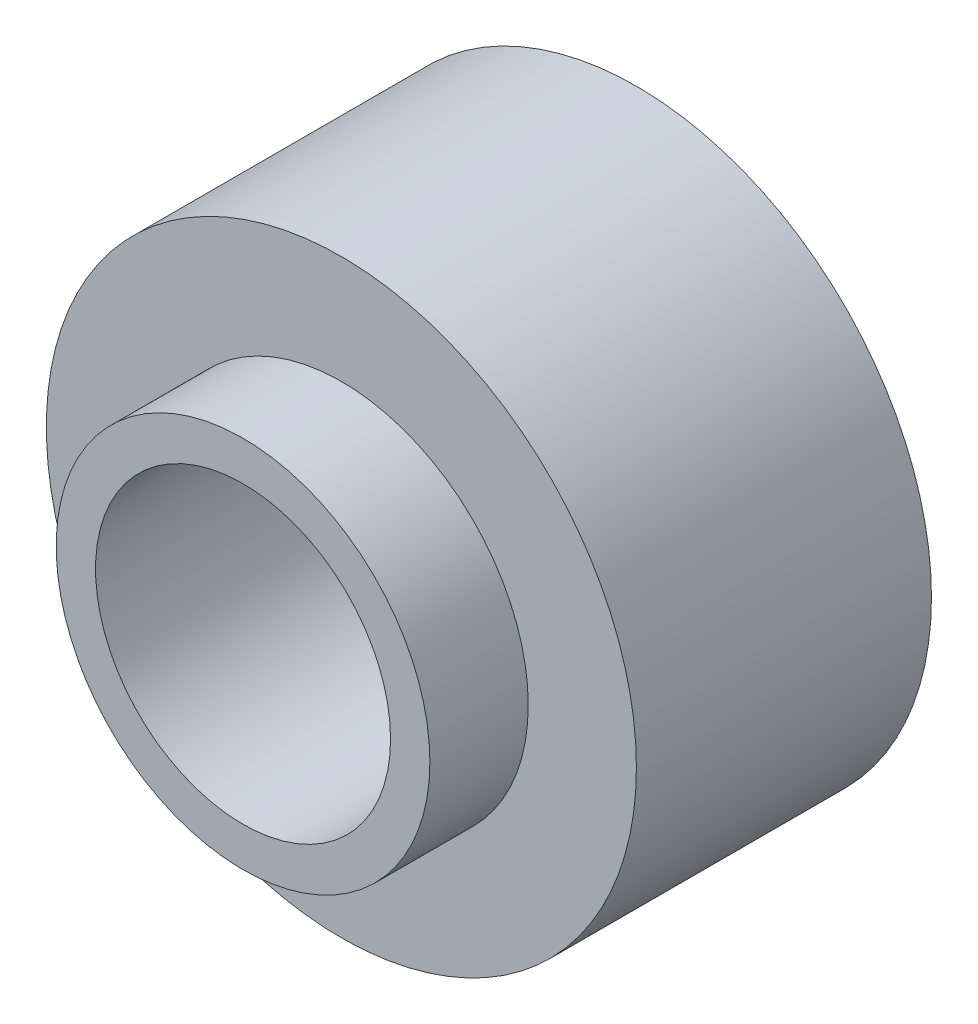
ISO-10303-21;
HEADER;
FILE_DESCRIPTION(('STEP AP214'),'2;1');
FILE_NAME('part.step','',(''),(''),'','','');
FILE_SCHEMA(('AUTOMOTIVE_DESIGN { 1 0 10303 214 1 1 1 1 }'));
ENDSEC;
DATA;
#1=APPLICATION_CONTEXT('core data for automotive mechanical design processes');
#2=APPLICATION_PROTOCOL_DEFINITION('international standard','automotive_design',2000,#1);
#3=PRODUCT_CONTEXT('',#1,'mechanical');
#4=PRODUCT('Part','Part','',(#3));
#5=PRODUCT_RELATED_PRODUCT_CATEGORY('part','',(#4));
#6=PRODUCT_DEFINITION_FORMATION('','',#4);
#7=PRODUCT_DEFINITION_CONTEXT('part definition',#1,'design');
#8=PRODUCT_DEFINITION('design','',#6,#7);
#9=PRODUCT_DEFINITION_SHAPE('','',#8);
#10=(LENGTH_UNIT() NAMED_UNIT(*) SI_UNIT(.MILLI.,.METRE.));
#11=(NAMED_UNIT(*) PLANE_ANGLE_UNIT() SI_UNIT($,.RADIAN.));
#12=(NAMED_UNIT(*) SI_UNIT($,.STERADIAN.) SOLID_ANGLE_UNIT());
#13=UNCERTAINTY_MEASURE_WITH_UNIT(LENGTH_MEASURE(1.E-05),#10,'distance_accuracy_value','');
#14=(GEOMETRIC_REPRESENTATION_CONTEXT(3) GLOBAL_UNCERTAINTY_ASSIGNED_CONTEXT((#13)) GLOBAL_UNIT_ASSIGNED_CONTEXT((#10,
#11,#12)) REPRESENTATION_CONTEXT('',''));
#15=CARTESIAN_POINT('',(0.,0.,0.));
#16=DIRECTION('',(0.,0.,1.));
#17=DIRECTION('',(1.,0.,0.));
#18=AXIS2_PLACEMENT_3D('',#15,#16,#17);
#19=CARTESIAN_POINT('',(0.,0.,-9.525));
#20=DIRECTION('',(0.,0.,1.));
#21=DIRECTION('',(1.,0.,0.));
#22=AXIS2_PLACEMENT_3D('',#19,#20,#21);
#23=CYLINDRICAL_SURFACE('',#22,9.525);
#24=CARTESIAN_POINT('',(0.,0.,-9.525));
#25=DIRECTION('',(0.,0.,1.));
#26=DIRECTION('',(1.,0.,0.));
#27=AXIS2_PLACEMENT_3D('',#24,#25,#26);
#28=CIRCLE('',#27,9.525);
#29=CARTESIAN_POINT('',(9.525,0.,-9.525));
#30=VERTEX_POINT('',#29);
#31=EDGE_CURVE('E47',#30,#30,#28,.T.);
#32=ORIENTED_EDGE('',*,*,#31,.T.);
#33=EDGE_LOOP('',(#32));
#34=FACE_BOUND('',#33,.T.);
#35=CARTESIAN_POINT('',(0.,0.,0.));
#36=DIRECTION('',(0.,0.,1.));
#37=DIRECTION('',(1.,0.,0.));
#38=AXIS2_PLACEMENT_3D('',#35,#36,#37);
#39=CIRCLE('',#38,9.525);
#40=CARTESIAN_POINT('',(9.525,0.,0.));
#41=VERTEX_POINT('',#40);
#42=EDGE_CURVE('E42',#41,#41,#39,.T.);
#43=ORIENTED_EDGE('',*,*,#42,.F.);
#44=EDGE_LOOP('',(#43));
#45=FACE_BOUND('',#44,.T.);
#46=ADVANCED_FACE('F39',(#34,#45),#23,.T.);
#47=CARTESIAN_POINT('',(0.,0.,-9.525));
#48=DIRECTION('',(0.,0.,1.));
#49=DIRECTION('',(1.,0.,0.));
#50=AXIS2_PLACEMENT_3D('',#47,#48,#49);
#51=CYLINDRICAL_SURFACE('',#50,4.7625);
#52=CARTESIAN_POINT('',(0.,0.,-9.525));
#53=DIRECTION('',(0.,0.,1.));
#54=DIRECTION('',(1.,0.,0.));
#55=AXIS2_PLACEMENT_3D('',#52,#53,#54);
#56=CIRCLE('',#55,4.7625);
#57=CARTESIAN_POINT('',(4.7625,0.,-9.525));
#58=VERTEX_POINT('',#57);
#59=EDGE_CURVE('E10',#58,#58,#56,.T.);
#60=ORIENTED_EDGE('',*,*,#59,.F.);
#61=EDGE_LOOP('',(#60));
#62=FACE_BOUND('',#61,.T.);
#63=CARTESIAN_POINT('',(0.,0.,3.175));
#64=DIRECTION('',(0.,0.,1.));
#65=DIRECTION('',(1.,0.,0.));
#66=AXIS2_PLACEMENT_3D('',#63,#64,#65);
#67=CIRCLE('',#66,4.7625);
#68=CARTESIAN_POINT('',(4.7625,0.,3.175));
#69=VERTEX_POINT('',#68);
#70=EDGE_CURVE('E58',#69,#69,#67,.T.);
#71=ORIENTED_EDGE('',*,*,#70,.T.);
#72=EDGE_LOOP('',(#71));
#73=FACE_BOUND('',#72,.T.);
#74=ADVANCED_FACE('F67',(#62,#73),#51,.F.);
#75=CARTESIAN_POINT('',(0.,0.,-9.525));
#76=DIRECTION('',(0.,0.,1.));
#77=DIRECTION('',(1.,0.,0.));
#78=AXIS2_PLACEMENT_3D('',#75,#76,#77);
#79=PLANE('',#78);
#80=ORIENTED_EDGE('',*,*,#31,.F.);
#81=EDGE_LOOP('',(#80));
#82=FACE_BOUND('',#81,.T.);
#83=ORIENTED_EDGE('',*,*,#59,.T.);
#84=EDGE_LOOP('',(#83));
#85=FACE_BOUND('',#84,.T.);
#86=ADVANCED_FACE('F84',(#82,#85),#79,.F.);
#87=CARTESIAN_POINT('',(0.,0.,0.));
#88=DIRECTION('',(0.,0.,1.));
#89=DIRECTION('',(1.,0.,0.));
#90=AXIS2_PLACEMENT_3D('',#87,#88,#89);
#91=PLANE('',#90);
#92=CARTESIAN_POINT('',(0.,0.,0.));
#93=DIRECTION('',(0.,0.,1.));
#94=DIRECTION('',(1.,0.,0.));
#95=AXIS2_PLACEMENT_3D('',#92,#93,#94);
#96=CIRCLE('',#95,6.0325);
#97=CARTESIAN_POINT('',(6.0325,0.,0.));
#98=VERTEX_POINT('',#97);
#99=EDGE_CURVE('E54',#98,#98,#96,.T.);
#100=ORIENTED_EDGE('',*,*,#99,.F.);
#101=EDGE_LOOP('',(#100));
#102=FACE_BOUND('',#101,.T.);
#103=ORIENTED_EDGE('',*,*,#42,.T.);
#104=EDGE_LOOP('',(#103));
#105=FACE_BOUND('',#104,.T.);
#106=ADVANCED_FACE('F78',(#102,#105),#91,.T.);
#107=CARTESIAN_POINT('',(0.,0.,3.175));
#108=DIRECTION('',(0.,0.,-1.));
#109=DIRECTION('',(-1.,0.,0.));
#110=AXIS2_PLACEMENT_3D('',#107,#108,#109);
#111=CYLINDRICAL_SURFACE('',#110,6.0325);
#112=CARTESIAN_POINT('',(0.,0.,3.175));
#113=DIRECTION('',(0.,0.,1.));
#114=DIRECTION('',(1.,0.,0.));
#115=AXIS2_PLACEMENT_3D('',#112,#113,#114);
#116=CIRCLE('',#115,6.0325);
#117=CARTESIAN_POINT('',(6.0325,0.,3.175));
#118=VERTEX_POINT('',#117);
#119=EDGE_CURVE('E59',#118,#118,#116,.T.);
#120=ORIENTED_EDGE('',*,*,#119,.F.);
#121=EDGE_LOOP('',(#120));
#122=FACE_BOUND('',#121,.T.);
#123=ORIENTED_EDGE('',*,*,#99,.T.);
#124=EDGE_LOOP('',(#123));
#125=FACE_BOUND('',#124,.T.);
#126=ADVANCED_FACE('F72',(#122,#125),#111,.T.);
#127=CARTESIAN_POINT('',(0.,0.,3.175));
#128=DIRECTION('',(0.,0.,1.));
#129=DIRECTION('',(1.,0.,0.));
#130=AXIS2_PLACEMENT_3D('',#127,#128,#129);
#131=PLANE('',#130);
#132=ORIENTED_EDGE('',*,*,#70,.F.);
#133=EDGE_LOOP('',(#132));
#134=FACE_BOUND('',#133,.T.);
#135=ORIENTED_EDGE('',*,*,#119,.T.);
#136=EDGE_LOOP('',(#135));
#137=FACE_BOUND('',#136,.T.);
#138=ADVANCED_FACE('F69',(#134,#137),#131,.T.);
#139=CLOSED_SHELL('',(#46,#74,#86,#106,#126,#138));
#140=MANIFOLD_SOLID_BREP('B2',#139);
#141=ADVANCED_BREP_SHAPE_REPRESENTATION('',(#18,#140),#14);
#142=SHAPE_DEFINITION_REPRESENTATION(#9,#141);
ENDSEC;
END-ISO-10303-21;
